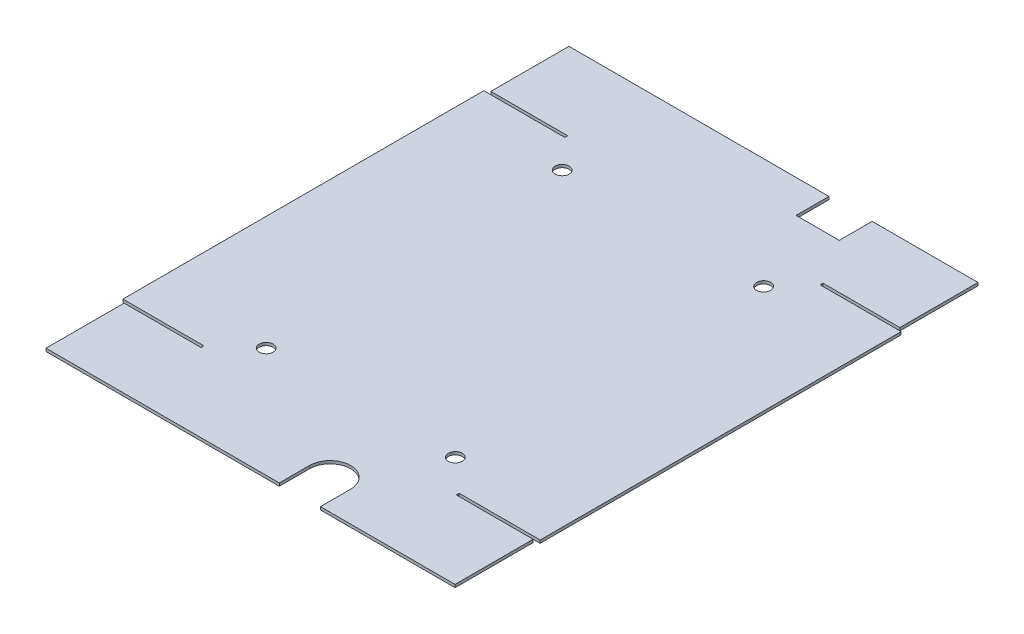
ISO-10303-21;
HEADER;
FILE_DESCRIPTION(('STEP AP214'),'2;1');
FILE_NAME('part.step','',(''),(''),'','','');
FILE_SCHEMA(('AUTOMOTIVE_DESIGN { 1 0 10303 214 1 1 1 1 }'));
ENDSEC;
DATA;
#1=APPLICATION_CONTEXT('core data for automotive mechanical design processes');
#2=APPLICATION_PROTOCOL_DEFINITION('international standard','automotive_design',2000,#1);
#3=PRODUCT_CONTEXT('',#1,'mechanical');
#4=PRODUCT('Part','Part','',(#3));
#5=PRODUCT_RELATED_PRODUCT_CATEGORY('part','',(#4));
#6=PRODUCT_DEFINITION_FORMATION('','',#4);
#7=PRODUCT_DEFINITION_CONTEXT('part definition',#1,'design');
#8=PRODUCT_DEFINITION('design','',#6,#7);
#9=PRODUCT_DEFINITION_SHAPE('','',#8);
#10=(LENGTH_UNIT() NAMED_UNIT(*) SI_UNIT(.MILLI.,.METRE.));
#11=(NAMED_UNIT(*) PLANE_ANGLE_UNIT() SI_UNIT($,.RADIAN.));
#12=(NAMED_UNIT(*) SI_UNIT($,.STERADIAN.) SOLID_ANGLE_UNIT());
#13=UNCERTAINTY_MEASURE_WITH_UNIT(LENGTH_MEASURE(1.E-05),#10,'distance_accuracy_value','');
#14=(GEOMETRIC_REPRESENTATION_CONTEXT(3) GLOBAL_UNCERTAINTY_ASSIGNED_CONTEXT((#13)) GLOBAL_UNIT_ASSIGNED_CONTEXT((#10,
#11,#12)) REPRESENTATION_CONTEXT('',''));
#15=CARTESIAN_POINT('',(0.,0.,0.));
#16=DIRECTION('',(0.,0.,1.));
#17=DIRECTION('',(1.,0.,0.));
#18=AXIS2_PLACEMENT_3D('',#15,#16,#17);
#19=CARTESIAN_POINT('',(0.,-0.7,87.8));
#20=DIRECTION('',(0.,1.,0.));
#21=DIRECTION('',(0.,0.,1.));
#22=AXIS2_PLACEMENT_3D('',#19,#20,#21);
#23=PLANE('',#22);
#24=CARTESIAN_POINT('',(54.05,-0.7,80.7));
#25=DIRECTION('',(0.,1.,0.));
#26=DIRECTION('',(0.,0.,1.));
#27=AXIS2_PLACEMENT_3D('',#24,#25,#26);
#28=CIRCLE('',#27,1.7);
#29=CARTESIAN_POINT('',(54.05,-0.7,82.4));
#30=VERTEX_POINT('',#29);
#31=EDGE_CURVE('E568',#30,#30,#28,.T.);
#32=ORIENTED_EDGE('',*,*,#31,.T.);
#33=EDGE_LOOP('',(#32));
#34=FACE_BOUND('',#33,.T.);
#35=CARTESIAN_POINT('',(8.05,-0.7,80.7));
#36=DIRECTION('',(0.,1.,0.));
#37=DIRECTION('',(0.,0.,1.));
#38=AXIS2_PLACEMENT_3D('',#35,#36,#37);
#39=CIRCLE('',#38,1.7);
#40=CARTESIAN_POINT('',(8.05,-0.7,82.4));
#41=VERTEX_POINT('',#40);
#42=EDGE_CURVE('E577',#41,#41,#39,.T.);
#43=ORIENTED_EDGE('',*,*,#42,.T.);
#44=EDGE_LOOP('',(#43));
#45=FACE_BOUND('',#44,.T.);
#46=CARTESIAN_POINT('',(55.55,-0.7,7.2));
#47=DIRECTION('',(0.,1.,0.));
#48=DIRECTION('',(0.,0.,1.));
#49=AXIS2_PLACEMENT_3D('',#46,#47,#48);
#50=CIRCLE('',#49,1.7);
#51=CARTESIAN_POINT('',(55.55,-0.7,8.9));
#52=VERTEX_POINT('',#51);
#53=EDGE_CURVE('E588',#52,#52,#50,.T.);
#54=ORIENTED_EDGE('',*,*,#53,.T.);
#55=EDGE_LOOP('',(#54));
#56=FACE_BOUND('',#55,.T.);
#57=CARTESIAN_POINT('',(6.55,-0.7,7.2));
#58=DIRECTION('',(0.,1.,0.));
#59=DIRECTION('',(0.,0.,1.));
#60=AXIS2_PLACEMENT_3D('',#57,#58,#59);
#61=CIRCLE('',#60,1.7);
#62=CARTESIAN_POINT('',(6.55,-0.7,8.9));
#63=VERTEX_POINT('',#62);
#64=EDGE_CURVE('E596',#63,#63,#61,.T.);
#65=ORIENTED_EDGE('',*,*,#64,.T.);
#66=EDGE_LOOP('',(#65));
#67=FACE_BOUND('',#66,.T.);
#68=DIRECTION('',(1.,0.,0.));
#69=VECTOR('',#68,1.);
#70=CARTESIAN_POINT('',(-0.78539816339745,-0.7,0.));
#71=LINE('',#70,#69);
#72=CARTESIAN_POINT('',(0.,-0.7,0.));
#73=VERTEX_POINT('',#72);
#74=CARTESIAN_POINT('',(-19.7,-0.699999999999872,0.));
#75=VERTEX_POINT('',#74);
#76=EDGE_CURVE('E733',#73,#75,#71,.F.);
#77=ORIENTED_EDGE('',*,*,#76,.F.);
#78=DIRECTION('',(0.,0.,1.));
#79=VECTOR('',#78,1.);
#80=CARTESIAN_POINT('',(0.,-0.7,-0.785398163397455));
#81=LINE('',#80,#79);
#82=CARTESIAN_POINT('',(0.,-0.699999999999992,-0.700000000000006));
#83=VERTEX_POINT('',#82);
#84=EDGE_CURVE('E561',#83,#73,#81,.T.);
#85=ORIENTED_EDGE('',*,*,#84,.F.);
#86=DIRECTION('',(1.,0.,0.));
#87=VECTOR('',#86,1.);
#88=CARTESIAN_POINT('',(0.299999999999995,-0.699999999999999,-0.700000000000006));
#89=LINE('',#88,#87);
#90=CARTESIAN_POINT('',(-18.7,-0.699999999999867,-0.700000000000006));
#91=VERTEX_POINT('',#90);
#92=EDGE_CURVE('E516',#83,#91,#89,.F.);
#93=ORIENTED_EDGE('',*,*,#92,.T.);
#94=DIRECTION('',(0.,0.,1.));
#95=VECTOR('',#94,1.);
#96=CARTESIAN_POINT('',(-18.7,-0.699999999999879,1.));
#97=LINE('',#96,#95);
#98=CARTESIAN_POINT('',(-18.7,-0.699999999999734,-19.7));
#99=VERTEX_POINT('',#98);
#100=EDGE_CURVE('E513',#91,#99,#97,.F.);
#101=ORIENTED_EDGE('',*,*,#100,.T.);
#102=DIRECTION('',(-1.,0.,0.));
#103=VECTOR('',#102,1.);
#104=CARTESIAN_POINT('',(0.299999999999994,-0.699999999999867,-19.7));
#105=LINE('',#104,#103);
#106=CARTESIAN_POINT('',(44.5506007,-0.699999999999859,-19.7));
#107=VERTEX_POINT('',#106);
#108=EDGE_CURVE('E510',#99,#107,#105,.F.);
#109=ORIENTED_EDGE('',*,*,#108,.T.);
#110=DIRECTION('',(0.,0.,1.));
#111=VECTOR('',#110,1.);
#112=CARTESIAN_POINT('',(44.5506007,-0.699999999999915,-11.7));
#113=LINE('',#112,#111);
#114=CARTESIAN_POINT('',(44.5506007,-0.699999999999915,-11.7));
#115=VERTEX_POINT('',#114);
#116=EDGE_CURVE('E460',#107,#115,#113,.T.);
#117=ORIENTED_EDGE('',*,*,#116,.T.);
#118=DIRECTION('',(1.,0.,0.));
#119=VECTOR('',#118,1.);
#120=CARTESIAN_POINT('',(55.0506007,-0.699999999999915,-11.7));
#121=LINE('',#120,#119);
#122=CARTESIAN_POINT('',(55.0506007,-0.699999999999915,-11.7));
#123=VERTEX_POINT('',#122);
#124=EDGE_CURVE('E789',#115,#123,#121,.T.);
#125=ORIENTED_EDGE('',*,*,#124,.T.);
#126=DIRECTION('',(0.,0.,-1.));
#127=VECTOR('',#126,1.);
#128=CARTESIAN_POINT('',(55.0506007,-0.699999999999859,-19.7));
#129=LINE('',#128,#127);
#130=CARTESIAN_POINT('',(55.0506007,-0.699999999999859,-19.7));
#131=VERTEX_POINT('',#130);
#132=EDGE_CURVE('E788',#123,#131,#129,.T.);
#133=ORIENTED_EDGE('',*,*,#132,.T.);
#134=DIRECTION('',(-1.,0.,0.));
#135=VECTOR('',#134,1.);
#136=CARTESIAN_POINT('',(61.7999999999998,-0.699999999999869,-19.7));
#137=LINE('',#136,#135);
#138=CARTESIAN_POINT('',(80.8,-0.69999999999973,-19.7));
#139=VERTEX_POINT('',#138);
#140=EDGE_CURVE('E541',#131,#139,#137,.F.);
#141=ORIENTED_EDGE('',*,*,#140,.T.);
#142=DIRECTION('',(0.,0.,-1.));
#143=VECTOR('',#142,1.);
#144=CARTESIAN_POINT('',(80.8,-0.699999999999872,1.));
#145=LINE('',#144,#143);
#146=CARTESIAN_POINT('',(80.8,-0.699999999999866,-0.700000000000006));
#147=VERTEX_POINT('',#146);
#148=EDGE_CURVE('E539',#139,#147,#145,.F.);
#149=ORIENTED_EDGE('',*,*,#148,.T.);
#150=DIRECTION('',(1.,0.,0.));
#151=VECTOR('',#150,1.);
#152=CARTESIAN_POINT('',(61.7999999999998,-0.700000000000005,-0.700000000000006));
#153=LINE('',#152,#151);
#154=CARTESIAN_POINT('',(62.1,-0.699999999999992,-0.700000000000006));
#155=VERTEX_POINT('',#154);
#156=EDGE_CURVE('E537',#147,#155,#153,.F.);
#157=ORIENTED_EDGE('',*,*,#156,.T.);
#158=DIRECTION('',(0.,0.,1.));
#159=VECTOR('',#158,1.);
#160=CARTESIAN_POINT('',(62.1,-0.7,-0.785398163397455));
#161=LINE('',#160,#159);
#162=CARTESIAN_POINT('',(62.1,-0.700000000000003,0.));
#163=VERTEX_POINT('',#162);
#164=EDGE_CURVE('E454',#163,#155,#161,.F.);
#165=ORIENTED_EDGE('',*,*,#164,.F.);
#166=DIRECTION('',(1.,0.,0.));
#167=VECTOR('',#166,1.);
#168=CARTESIAN_POINT('',(62.8853981633975,-0.7,0.));
#169=LINE('',#168,#167);
#170=CARTESIAN_POINT('',(81.8,-0.699999999999867,0.));
#171=VERTEX_POINT('',#170);
#172=EDGE_CURVE('E231',#171,#163,#169,.F.);
#173=ORIENTED_EDGE('',*,*,#172,.F.);
#174=DIRECTION('',(0.,0.,-1.));
#175=VECTOR('',#174,1.);
#176=CARTESIAN_POINT('',(81.8,-0.699999999999867,0.));
#177=LINE('',#176,#175);
#178=CARTESIAN_POINT('',(81.8,-0.699999999999867,87.8));
#179=VERTEX_POINT('',#178);
#180=EDGE_CURVE('E418',#171,#179,#177,.F.);
#181=ORIENTED_EDGE('',*,*,#180,.T.);
#182=DIRECTION('',(1.,0.,0.));
#183=VECTOR('',#182,1.);
#184=CARTESIAN_POINT('',(62.8853981633975,-0.7,87.8));
#185=LINE('',#184,#183);
#186=CARTESIAN_POINT('',(62.1,-0.7,87.8));
#187=VERTEX_POINT('',#186);
#188=EDGE_CURVE('E419',#187,#179,#185,.T.);
#189=ORIENTED_EDGE('',*,*,#188,.F.);
#190=DIRECTION('',(0.,0.,1.));
#191=VECTOR('',#190,1.);
#192=CARTESIAN_POINT('',(62.1,-0.7,88.5853981633975));
#193=LINE('',#192,#191);
#194=CARTESIAN_POINT('',(62.1,-0.700000000000006,88.5));
#195=VERTEX_POINT('',#194);
#196=EDGE_CURVE('E448',#195,#187,#193,.F.);
#197=ORIENTED_EDGE('',*,*,#196,.F.);
#198=DIRECTION('',(-1.,0.,0.));
#199=VECTOR('',#198,1.);
#200=CARTESIAN_POINT('',(149.6,-0.699999999999396,88.5));
#201=LINE('',#200,#199);
#202=CARTESIAN_POINT('',(80.8,-0.699999999999867,88.5));
#203=VERTEX_POINT('',#202);
#204=EDGE_CURVE('E692',#195,#203,#201,.F.);
#205=ORIENTED_EDGE('',*,*,#204,.T.);
#206=DIRECTION('',(0.,0.,-1.));
#207=VECTOR('',#206,1.);
#208=CARTESIAN_POINT('',(80.8,-0.699999999999867,86.7999999999997));
#209=LINE('',#208,#207);
#210=CARTESIAN_POINT('',(80.8,-0.699999999999729,107.5));
#211=VERTEX_POINT('',#210);
#212=EDGE_CURVE('E685',#203,#211,#209,.F.);
#213=ORIENTED_EDGE('',*,*,#212,.T.);
#214=DIRECTION('',(1.,0.,0.));
#215=VECTOR('',#214,1.);
#216=CARTESIAN_POINT('',(149.6,-0.699999999999257,107.5));
#217=LINE('',#216,#215);
#218=CARTESIAN_POINT('',(48.05,-0.699999999999923,107.5));
#219=VERTEX_POINT('',#218);
#220=EDGE_CURVE('E683',#211,#219,#217,.F.);
#221=ORIENTED_EDGE('',*,*,#220,.T.);
#222=DIRECTION('',(0.,0.,-1.));
#223=VECTOR('',#222,1.);
#224=CARTESIAN_POINT('',(48.05,-0.699999999999923,107.5));
#225=LINE('',#224,#223);
#226=CARTESIAN_POINT('',(48.05,-0.699999999999951,100.15));
#227=VERTEX_POINT('',#226);
#228=EDGE_CURVE('E663',#219,#227,#225,.T.);
#229=ORIENTED_EDGE('',*,*,#228,.T.);
#230=CARTESIAN_POINT('',(43.05,-0.699999999999951,100.15));
#231=DIRECTION('',(0.,1.,0.));
#232=DIRECTION('',(1.,0.,0.));
#233=AXIS2_PLACEMENT_3D('',#230,#231,#232);
#234=CIRCLE('',#233,5.);
#235=CARTESIAN_POINT('',(38.05,-0.699999999999951,100.15));
#236=VERTEX_POINT('',#235);
#237=EDGE_CURVE('E660',#227,#236,#234,.T.);
#238=ORIENTED_EDGE('',*,*,#237,.T.);
#239=DIRECTION('',(0.,0.,1.));
#240=VECTOR('',#239,1.);
#241=CARTESIAN_POINT('',(38.05,-0.699999999999951,100.15));
#242=LINE('',#241,#240);
#243=CARTESIAN_POINT('',(38.05,-0.699999999999923,107.5));
#244=VERTEX_POINT('',#243);
#245=EDGE_CURVE('E656',#236,#244,#242,.T.);
#246=ORIENTED_EDGE('',*,*,#245,.T.);
#247=DIRECTION('',(1.,0.,0.));
#248=VECTOR('',#247,1.);
#249=CARTESIAN_POINT('',(-87.5,-0.699999999999257,107.5));
#250=LINE('',#249,#248);
#251=CARTESIAN_POINT('',(-18.7,-0.699999999999742,107.5));
#252=VERTEX_POINT('',#251);
#253=EDGE_CURVE('E1328',#244,#252,#250,.F.);
#254=ORIENTED_EDGE('',*,*,#253,.T.);
#255=DIRECTION('',(0.,0.,1.));
#256=VECTOR('',#255,1.);
#257=CARTESIAN_POINT('',(-18.7,-0.699999999999881,86.7999999999997));
#258=LINE('',#257,#256);
#259=CARTESIAN_POINT('',(-18.7,-0.699999999999867,88.5));
#260=VERTEX_POINT('',#259);
#261=EDGE_CURVE('E1331',#252,#260,#258,.F.);
#262=ORIENTED_EDGE('',*,*,#261,.T.);
#263=DIRECTION('',(-1.,0.,0.));
#264=VECTOR('',#263,1.);
#265=CARTESIAN_POINT('',(-87.5,-0.699999999999396,88.5000000000001));
#266=LINE('',#265,#264);
#267=CARTESIAN_POINT('',(0.,-0.699999999999978,88.5));
#268=VERTEX_POINT('',#267);
#269=EDGE_CURVE('E1333',#260,#268,#266,.F.);
#270=ORIENTED_EDGE('',*,*,#269,.T.);
#271=DIRECTION('',(0.,0.,1.));
#272=VECTOR('',#271,1.);
#273=CARTESIAN_POINT('',(0.,-0.7,88.5853981633975));
#274=LINE('',#273,#272);
#275=CARTESIAN_POINT('',(0.,-0.7,87.8));
#276=VERTEX_POINT('',#275);
#277=EDGE_CURVE('E239',#276,#268,#274,.T.);
#278=ORIENTED_EDGE('',*,*,#277,.F.);
#279=DIRECTION('',(1.,0.,0.));
#280=VECTOR('',#279,1.);
#281=CARTESIAN_POINT('',(-0.78539816339745,-0.7,87.8));
#282=LINE('',#281,#280);
#283=CARTESIAN_POINT('',(-19.7,-0.699999999999872,87.8));
#284=VERTEX_POINT('',#283);
#285=EDGE_CURVE('E727',#284,#276,#282,.T.);
#286=ORIENTED_EDGE('',*,*,#285,.F.);
#287=DIRECTION('',(0.,0.,1.));
#288=VECTOR('',#287,1.);
#289=CARTESIAN_POINT('',(-19.7,-0.699999999999872,0.));
#290=LINE('',#289,#288);
#291=EDGE_CURVE('E744',#284,#75,#290,.F.);
#292=ORIENTED_EDGE('',*,*,#291,.T.);
#293=EDGE_LOOP('',(#77,#85,#93,#101,#109,#117,#125,#133,#141,#149,#157,#165,#173,#181,#189,#197,
#205,#213,#221,#229,#238,#246,#254,#262,#270,#278,#286,#292));
#294=FACE_BOUND('',#293,.T.);
#295=ADVANCED_FACE('F216',(#34,#45,#56,#67,#294),#23,.F.);
#296=CARTESIAN_POINT('',(0.,0.,87.8));
#297=DIRECTION('',(0.,1.,0.));
#298=DIRECTION('',(0.,0.,1.));
#299=AXIS2_PLACEMENT_3D('',#296,#297,#298);
#300=PLANE('',#299);
#301=CARTESIAN_POINT('',(54.05,0.,80.7));
#302=DIRECTION('',(0.,1.,0.));
#303=DIRECTION('',(0.,0.,1.));
#304=AXIS2_PLACEMENT_3D('',#301,#302,#303);
#305=CIRCLE('',#304,1.7);
#306=CARTESIAN_POINT('',(54.05,0.,82.4));
#307=VERTEX_POINT('',#306);
#308=EDGE_CURVE('E572',#307,#307,#305,.T.);
#309=ORIENTED_EDGE('',*,*,#308,.F.);
#310=EDGE_LOOP('',(#309));
#311=FACE_BOUND('',#310,.T.);
#312=CARTESIAN_POINT('',(8.05,0.,80.7));
#313=DIRECTION('',(0.,1.,0.));
#314=DIRECTION('',(0.,0.,1.));
#315=AXIS2_PLACEMENT_3D('',#312,#313,#314);
#316=CIRCLE('',#315,1.7);
#317=CARTESIAN_POINT('',(8.05,0.,82.4));
#318=VERTEX_POINT('',#317);
#319=EDGE_CURVE('E571',#318,#318,#316,.T.);
#320=ORIENTED_EDGE('',*,*,#319,.F.);
#321=EDGE_LOOP('',(#320));
#322=FACE_BOUND('',#321,.T.);
#323=CARTESIAN_POINT('',(55.55,0.,7.2));
#324=DIRECTION('',(0.,1.,0.));
#325=DIRECTION('',(0.,0.,1.));
#326=AXIS2_PLACEMENT_3D('',#323,#324,#325);
#327=CIRCLE('',#326,1.7);
#328=CARTESIAN_POINT('',(55.55,0.,8.9));
#329=VERTEX_POINT('',#328);
#330=EDGE_CURVE('E591',#329,#329,#327,.T.);
#331=ORIENTED_EDGE('',*,*,#330,.F.);
#332=EDGE_LOOP('',(#331));
#333=FACE_BOUND('',#332,.T.);
#334=CARTESIAN_POINT('',(6.55,0.,7.2));
#335=DIRECTION('',(0.,1.,0.));
#336=DIRECTION('',(0.,0.,1.));
#337=AXIS2_PLACEMENT_3D('',#334,#335,#336);
#338=CIRCLE('',#337,1.7);
#339=CARTESIAN_POINT('',(6.55,0.,8.9));
#340=VERTEX_POINT('',#339);
#341=EDGE_CURVE('E590',#340,#340,#338,.T.);
#342=ORIENTED_EDGE('',*,*,#341,.F.);
#343=EDGE_LOOP('',(#342));
#344=FACE_BOUND('',#343,.T.);
#345=DIRECTION('',(-1.,0.,0.));
#346=VECTOR('',#345,1.);
#347=CARTESIAN_POINT('',(62.1,0.,0.));
#348=LINE('',#347,#346);
#349=CARTESIAN_POINT('',(81.8,1.38777878078145E-13,0.));
#350=VERTEX_POINT('',#349);
#351=CARTESIAN_POINT('',(62.1,0.,0.));
#352=VERTEX_POINT('',#351);
#353=EDGE_CURVE('E399',#350,#352,#348,.T.);
#354=ORIENTED_EDGE('',*,*,#353,.T.);
#355=DIRECTION('',(0.,0.,-1.));
#356=VECTOR('',#355,1.);
#357=CARTESIAN_POINT('',(62.1,0.,-0.699999999999992));
#358=LINE('',#357,#356);
#359=CARTESIAN_POINT('',(62.1,0.,-0.700000000000006));
#360=VERTEX_POINT('',#359);
#361=EDGE_CURVE('E563',#352,#360,#358,.T.);
#362=ORIENTED_EDGE('',*,*,#361,.T.);
#363=DIRECTION('',(-1.,0.,0.));
#364=VECTOR('',#363,1.);
#365=CARTESIAN_POINT('',(60.8,0.,-0.700000000000006));
#366=LINE('',#365,#364);
#367=CARTESIAN_POINT('',(80.8,1.40295761119624E-13,-0.699999999999992));
#368=VERTEX_POINT('',#367);
#369=EDGE_CURVE('E492',#368,#360,#366,.T.);
#370=ORIENTED_EDGE('',*,*,#369,.F.);
#371=DIRECTION('',(0.,0.,1.));
#372=VECTOR('',#371,1.);
#373=CARTESIAN_POINT('',(80.8,1.40295761119624E-13,-0.699999999999992));
#374=LINE('',#373,#372);
#375=CARTESIAN_POINT('',(80.8,2.76037873114809E-13,-19.7));
#376=VERTEX_POINT('',#375);
#377=EDGE_CURVE('E503',#376,#368,#374,.T.);
#378=ORIENTED_EDGE('',*,*,#377,.F.);
#379=DIRECTION('',(1.,0.,0.));
#380=VECTOR('',#379,1.);
#381=CARTESIAN_POINT('',(80.8,2.76037873114809E-13,-19.7));
#382=LINE('',#381,#380);
#383=CARTESIAN_POINT('',(55.0506007,1.40946282423116E-13,-19.7));
#384=VERTEX_POINT('',#383);
#385=EDGE_CURVE('E558',#384,#376,#382,.T.);
#386=ORIENTED_EDGE('',*,*,#385,.F.);
#387=DIRECTION('',(0.,0.,-1.));
#388=VECTOR('',#387,1.);
#389=CARTESIAN_POINT('',(55.0506007,1.40946282423116E-13,-19.7));
#390=LINE('',#389,#388);
#391=CARTESIAN_POINT('',(55.0506007,0.,-11.7));
#392=VERTEX_POINT('',#391);
#393=EDGE_CURVE('E455',#392,#384,#390,.T.);
#394=ORIENTED_EDGE('',*,*,#393,.F.);
#395=DIRECTION('',(1.,0.,0.));
#396=VECTOR('',#395,1.);
#397=CARTESIAN_POINT('',(55.0506007,0.,-11.7));
#398=LINE('',#397,#396);
#399=CARTESIAN_POINT('',(44.5506007,0.,-11.7));
#400=VERTEX_POINT('',#399);
#401=EDGE_CURVE('E471',#400,#392,#398,.T.);
#402=ORIENTED_EDGE('',*,*,#401,.F.);
#403=DIRECTION('',(0.,0.,1.));
#404=VECTOR('',#403,1.);
#405=CARTESIAN_POINT('',(44.5506007,0.,-11.7));
#406=LINE('',#405,#404);
#407=CARTESIAN_POINT('',(44.5506007,1.40946282423116E-13,-19.7));
#408=VERTEX_POINT('',#407);
#409=EDGE_CURVE('E481',#408,#400,#406,.T.);
#410=ORIENTED_EDGE('',*,*,#409,.F.);
#411=DIRECTION('',(1.,0.,0.));
#412=VECTOR('',#411,1.);
#413=CARTESIAN_POINT('',(1.29999999999999,1.2641797331181E-13,-19.7));
#414=LINE('',#413,#412);
#415=CARTESIAN_POINT('',(-18.7,2.66063213127943E-13,-19.7));
#416=VERTEX_POINT('',#415);
#417=EDGE_CURVE('E525',#416,#408,#414,.T.);
#418=ORIENTED_EDGE('',*,*,#417,.F.);
#419=DIRECTION('',(0.,0.,-1.));
#420=VECTOR('',#419,1.);
#421=CARTESIAN_POINT('',(-18.7,2.66063213127943E-13,-19.7));
#422=LINE('',#421,#420);
#423=CARTESIAN_POINT('',(-18.7,1.33356867215717E-13,-0.700000000000006));
#424=VERTEX_POINT('',#423);
#425=EDGE_CURVE('E520',#424,#416,#422,.T.);
#426=ORIENTED_EDGE('',*,*,#425,.F.);
#427=DIRECTION('',(-1.,0.,0.));
#428=VECTOR('',#427,1.);
#429=CARTESIAN_POINT('',(-18.7,1.33356867215717E-13,-0.700000000000006));
#430=LINE('',#429,#428);
#431=CARTESIAN_POINT('',(0.,0.,-0.699999999999992));
#432=VERTEX_POINT('',#431);
#433=EDGE_CURVE('E533',#432,#424,#430,.T.);
#434=ORIENTED_EDGE('',*,*,#433,.F.);
#435=DIRECTION('',(0.,0.,1.));
#436=VECTOR('',#435,1.);
#437=CARTESIAN_POINT('',(0.,0.,0.));
#438=LINE('',#437,#436);
#439=CARTESIAN_POINT('',(0.,0.,0.));
#440=VERTEX_POINT('',#439);
#441=EDGE_CURVE('E565',#432,#440,#438,.T.);
#442=ORIENTED_EDGE('',*,*,#441,.T.);
#443=DIRECTION('',(-1.,0.,0.));
#444=VECTOR('',#443,1.);
#445=CARTESIAN_POINT('',(-0.699999999999997,0.,0.));
#446=LINE('',#445,#444);
#447=CARTESIAN_POINT('',(-19.7,1.2793585635329E-13,0.));
#448=VERTEX_POINT('',#447);
#449=EDGE_CURVE('E721',#440,#448,#446,.T.);
#450=ORIENTED_EDGE('',*,*,#449,.T.);
#451=DIRECTION('',(0.,0.,-1.));
#452=VECTOR('',#451,1.);
#453=CARTESIAN_POINT('',(-19.7,1.2793585635329E-13,0.));
#454=LINE('',#453,#452);
#455=CARTESIAN_POINT('',(-19.7,1.2793585635329E-13,87.8));
#456=VERTEX_POINT('',#455);
#457=EDGE_CURVE('E409',#456,#448,#454,.T.);
#458=ORIENTED_EDGE('',*,*,#457,.F.);
#459=DIRECTION('',(1.,0.,0.));
#460=VECTOR('',#459,1.);
#461=CARTESIAN_POINT('',(0.,0.,87.8));
#462=LINE('',#461,#460);
#463=CARTESIAN_POINT('',(0.,0.,87.8));
#464=VERTEX_POINT('',#463);
#465=EDGE_CURVE('E715',#456,#464,#462,.T.);
#466=ORIENTED_EDGE('',*,*,#465,.T.);
#467=DIRECTION('',(0.,0.,1.));
#468=VECTOR('',#467,1.);
#469=CARTESIAN_POINT('',(0.,0.,88.5));
#470=LINE('',#469,#468);
#471=CARTESIAN_POINT('',(0.,0.,88.5));
#472=VERTEX_POINT('',#471);
#473=EDGE_CURVE('E444',#464,#472,#470,.T.);
#474=ORIENTED_EDGE('',*,*,#473,.T.);
#475=DIRECTION('',(1.,0.,0.));
#476=VECTOR('',#475,1.);
#477=CARTESIAN_POINT('',(1.29999999999998,0.,88.5));
#478=LINE('',#477,#476);
#479=CARTESIAN_POINT('',(-18.7,1.2490009027033E-13,88.5));
#480=VERTEX_POINT('',#479);
#481=EDGE_CURVE('E639',#480,#472,#478,.T.);
#482=ORIENTED_EDGE('',*,*,#481,.F.);
#483=DIRECTION('',(0.,0.,-1.));
#484=VECTOR('',#483,1.);
#485=CARTESIAN_POINT('',(-18.7,1.2490009027033E-13,88.5));
#486=LINE('',#485,#484);
#487=CARTESIAN_POINT('',(-18.7,2.63677968348475E-13,107.5));
#488=VERTEX_POINT('',#487);
#489=EDGE_CURVE('E686',#488,#480,#486,.T.);
#490=ORIENTED_EDGE('',*,*,#489,.F.);
#491=DIRECTION('',(-1.,0.,0.));
#492=VECTOR('',#491,1.);
#493=CARTESIAN_POINT('',(-18.7,2.63677968348475E-13,107.5));
#494=LINE('',#493,#492);
#495=CARTESIAN_POINT('',(38.05,1.52655665885959E-13,107.5));
#496=VERTEX_POINT('',#495);
#497=EDGE_CURVE('E710',#496,#488,#494,.T.);
#498=ORIENTED_EDGE('',*,*,#497,.F.);
#499=DIRECTION('',(0.,0.,1.));
#500=VECTOR('',#499,1.);
#501=CARTESIAN_POINT('',(38.05,0.,100.15));
#502=LINE('',#501,#500);
#503=CARTESIAN_POINT('',(38.05,0.,100.15));
#504=VERTEX_POINT('',#503);
#505=EDGE_CURVE('E634',#504,#496,#502,.T.);
#506=ORIENTED_EDGE('',*,*,#505,.F.);
#507=CARTESIAN_POINT('',(43.05,0.,100.15));
#508=DIRECTION('',(0.,1.,0.));
#509=DIRECTION('',(1.,0.,0.));
#510=AXIS2_PLACEMENT_3D('',#507,#508,#509);
#511=CIRCLE('',#510,5.);
#512=CARTESIAN_POINT('',(48.05,0.,100.15));
#513=VERTEX_POINT('',#512);
#514=EDGE_CURVE('E650',#513,#504,#511,.T.);
#515=ORIENTED_EDGE('',*,*,#514,.F.);
#516=DIRECTION('',(0.,0.,-1.));
#517=VECTOR('',#516,1.);
#518=CARTESIAN_POINT('',(48.05,0.,107.5));
#519=LINE('',#518,#517);
#520=CARTESIAN_POINT('',(48.05,0.,107.5));
#521=VERTEX_POINT('',#520);
#522=EDGE_CURVE('E620',#521,#513,#519,.T.);
#523=ORIENTED_EDGE('',*,*,#522,.F.);
#524=DIRECTION('',(-1.,0.,0.));
#525=VECTOR('',#524,1.);
#526=CARTESIAN_POINT('',(60.8,1.38777878078145E-13,107.5));
#527=LINE('',#526,#525);
#528=CARTESIAN_POINT('',(80.8,2.77555756156289E-13,107.5));
#529=VERTEX_POINT('',#528);
#530=EDGE_CURVE('E676',#529,#521,#527,.T.);
#531=ORIENTED_EDGE('',*,*,#530,.F.);
#532=DIRECTION('',(0.,0.,1.));
#533=VECTOR('',#532,1.);
#534=CARTESIAN_POINT('',(80.8,2.77555756156289E-13,107.5));
#535=LINE('',#534,#533);
#536=CARTESIAN_POINT('',(80.8,1.38777878078145E-13,88.5));
#537=VERTEX_POINT('',#536);
#538=EDGE_CURVE('E700',#537,#529,#535,.T.);
#539=ORIENTED_EDGE('',*,*,#538,.F.);
#540=DIRECTION('',(1.,0.,0.));
#541=VECTOR('',#540,1.);
#542=CARTESIAN_POINT('',(80.8,1.38777878078145E-13,88.5));
#543=LINE('',#542,#541);
#544=CARTESIAN_POINT('',(62.1,0.,88.5));
#545=VERTEX_POINT('',#544);
#546=EDGE_CURVE('E1336',#545,#537,#543,.T.);
#547=ORIENTED_EDGE('',*,*,#546,.F.);
#548=DIRECTION('',(0.,0.,-1.));
#549=VECTOR('',#548,1.);
#550=CARTESIAN_POINT('',(62.1,0.,87.8));
#551=LINE('',#550,#549);
#552=CARTESIAN_POINT('',(62.1,0.,87.8));
#553=VERTEX_POINT('',#552);
#554=EDGE_CURVE('E438',#545,#553,#551,.T.);
#555=ORIENTED_EDGE('',*,*,#554,.T.);
#556=DIRECTION('',(1.,0.,0.));
#557=VECTOR('',#556,1.);
#558=CARTESIAN_POINT('',(62.8,0.,87.8));
#559=LINE('',#558,#557);
#560=CARTESIAN_POINT('',(81.8,1.38777878078145E-13,87.8));
#561=VERTEX_POINT('',#560);
#562=EDGE_CURVE('E410',#553,#561,#559,.T.);
#563=ORIENTED_EDGE('',*,*,#562,.T.);
#564=DIRECTION('',(0.,0.,1.));
#565=VECTOR('',#564,1.);
#566=CARTESIAN_POINT('',(81.8,1.38777878078145E-13,87.8));
#567=LINE('',#566,#565);
#568=EDGE_CURVE('E416',#350,#561,#567,.T.);
#569=ORIENTED_EDGE('',*,*,#568,.F.);
#570=EDGE_LOOP('',(#354,#362,#370,#378,#386,#394,#402,#410,#418,#426,#434,#442,#450,#458,#466,
#474,#482,#490,#498,#506,#515,#523,#531,#539,#547,#555,#563,#569));
#571=FACE_BOUND('',#570,.T.);
#572=ADVANCED_FACE('F218',(#311,#322,#333,#344,#571),#300,.T.);
#573=CARTESIAN_POINT('',(6.55,-0.7,7.2));
#574=DIRECTION('',(0.,1.,0.));
#575=DIRECTION('',(0.,0.,1.));
#576=AXIS2_PLACEMENT_3D('',#573,#574,#575);
#577=CYLINDRICAL_SURFACE('',#576,1.7);
#578=ORIENTED_EDGE('',*,*,#64,.F.);
#579=EDGE_LOOP('',(#578));
#580=FACE_BOUND('',#579,.T.);
#581=ORIENTED_EDGE('',*,*,#341,.T.);
#582=EDGE_LOOP('',(#581));
#583=FACE_BOUND('',#582,.T.);
#584=ADVANCED_FACE('F820',(#580,#583),#577,.F.);
#585=CARTESIAN_POINT('',(55.55,-0.7,7.2));
#586=DIRECTION('',(0.,1.,0.));
#587=DIRECTION('',(0.,0.,1.));
#588=AXIS2_PLACEMENT_3D('',#585,#586,#587);
#589=CYLINDRICAL_SURFACE('',#588,1.7);
#590=ORIENTED_EDGE('',*,*,#53,.F.);
#591=EDGE_LOOP('',(#590));
#592=FACE_BOUND('',#591,.T.);
#593=ORIENTED_EDGE('',*,*,#330,.T.);
#594=EDGE_LOOP('',(#593));
#595=FACE_BOUND('',#594,.T.);
#596=ADVANCED_FACE('F826',(#592,#595),#589,.F.);
#597=CARTESIAN_POINT('',(8.05,-0.7,80.7));
#598=DIRECTION('',(0.,1.,0.));
#599=DIRECTION('',(0.,0.,1.));
#600=AXIS2_PLACEMENT_3D('',#597,#598,#599);
#601=CYLINDRICAL_SURFACE('',#600,1.7);
#602=ORIENTED_EDGE('',*,*,#42,.F.);
#603=EDGE_LOOP('',(#602));
#604=FACE_BOUND('',#603,.T.);
#605=ORIENTED_EDGE('',*,*,#319,.T.);
#606=EDGE_LOOP('',(#605));
#607=FACE_BOUND('',#606,.T.);
#608=ADVANCED_FACE('F830',(#604,#607),#601,.F.);
#609=CARTESIAN_POINT('',(54.05,-0.7,80.7));
#610=DIRECTION('',(0.,1.,0.));
#611=DIRECTION('',(0.,0.,1.));
#612=AXIS2_PLACEMENT_3D('',#609,#610,#611);
#613=CYLINDRICAL_SURFACE('',#612,1.7);
#614=ORIENTED_EDGE('',*,*,#31,.F.);
#615=EDGE_LOOP('',(#614));
#616=FACE_BOUND('',#615,.T.);
#617=ORIENTED_EDGE('',*,*,#308,.T.);
#618=EDGE_LOOP('',(#617));
#619=FACE_BOUND('',#618,.T.);
#620=ADVANCED_FACE('F834',(#616,#619),#613,.F.);
#621=CARTESIAN_POINT('',(62.1,0.,-0.699999999999992));
#622=DIRECTION('',(1.,0.,0.));
#623=DIRECTION('',(0.,0.,-1.));
#624=AXIS2_PLACEMENT_3D('',#621,#622,#623);
#625=PLANE('',#624);
#626=DIRECTION('',(0.,-1.,0.));
#627=VECTOR('',#626,1.);
#628=CARTESIAN_POINT('',(62.1,0.,0.));
#629=LINE('',#628,#627);
#630=EDGE_CURVE('E14',#352,#163,#629,.T.);
#631=ORIENTED_EDGE('',*,*,#630,.T.);
#632=ORIENTED_EDGE('',*,*,#164,.T.);
#633=DIRECTION('',(0.,1.,0.));
#634=VECTOR('',#633,1.);
#635=CARTESIAN_POINT('',(62.1,-0.699999999999992,-0.700000000000006));
#636=LINE('',#635,#634);
#637=EDGE_CURVE('E443',#155,#360,#636,.T.);
#638=ORIENTED_EDGE('',*,*,#637,.T.);
#639=ORIENTED_EDGE('',*,*,#361,.F.);
#640=EDGE_LOOP('',(#631,#632,#638,#639));
#641=FACE_BOUND('',#640,.T.);
#642=ADVANCED_FACE('F560',(#641),#625,.T.);
#643=CARTESIAN_POINT('',(0.,0.,0.));
#644=DIRECTION('',(-1.,0.,0.));
#645=DIRECTION('',(0.,0.,1.));
#646=AXIS2_PLACEMENT_3D('',#643,#644,#645);
#647=PLANE('',#646);
#648=ORIENTED_EDGE('',*,*,#84,.T.);
#649=DIRECTION('',(0.,1.,0.));
#650=VECTOR('',#649,1.);
#651=CARTESIAN_POINT('',(0.,-0.7,0.));
#652=LINE('',#651,#650);
#653=EDGE_CURVE('E599',#73,#440,#652,.T.);
#654=ORIENTED_EDGE('',*,*,#653,.T.);
#655=ORIENTED_EDGE('',*,*,#441,.F.);
#656=DIRECTION('',(0.,1.,0.));
#657=VECTOR('',#656,1.);
#658=CARTESIAN_POINT('',(0.,0.,-0.699999999999992));
#659=LINE('',#658,#657);
#660=EDGE_CURVE('E486',#83,#432,#659,.T.);
#661=ORIENTED_EDGE('',*,*,#660,.F.);
#662=EDGE_LOOP('',(#648,#654,#655,#661));
#663=FACE_BOUND('',#662,.T.);
#664=ADVANCED_FACE('F768',(#663),#647,.T.);
#665=CARTESIAN_POINT('',(80.8,2.76037873114809E-13,-19.7));
#666=DIRECTION('',(0.,0.,-1.));
#667=DIRECTION('',(-1.,0.,0.));
#668=AXIS2_PLACEMENT_3D('',#665,#666,#667);
#669=PLANE('',#668);
#670=ORIENTED_EDGE('',*,*,#140,.F.);
#671=DIRECTION('',(0.,1.,0.));
#672=VECTOR('',#671,1.);
#673=CARTESIAN_POINT('',(55.0506007,-0.699999999999859,-19.7));
#674=LINE('',#673,#672);
#675=EDGE_CURVE('E489',#131,#384,#674,.T.);
#676=ORIENTED_EDGE('',*,*,#675,.T.);
#677=ORIENTED_EDGE('',*,*,#385,.T.);
#678=DIRECTION('',(0.,-1.,0.));
#679=VECTOR('',#678,1.);
#680=CARTESIAN_POINT('',(80.8,2.76037873114809E-13,-19.7));
#681=LINE('',#680,#679);
#682=EDGE_CURVE('E800',#376,#139,#681,.T.);
#683=ORIENTED_EDGE('',*,*,#682,.T.);
#684=EDGE_LOOP('',(#670,#676,#677,#683));
#685=FACE_BOUND('',#684,.T.);
#686=ADVANCED_FACE('F799',(#685),#669,.T.);
#687=CARTESIAN_POINT('',(1.29999999999999,1.2641797331181E-13,-19.7));
#688=DIRECTION('',(0.,0.,-1.));
#689=DIRECTION('',(1.,0.,0.));
#690=AXIS2_PLACEMENT_3D('',#687,#688,#689);
#691=PLANE('',#690);
#692=ORIENTED_EDGE('',*,*,#417,.T.);
#693=DIRECTION('',(0.,1.,0.));
#694=VECTOR('',#693,1.);
#695=CARTESIAN_POINT('',(44.5506007,-0.699999999999859,-19.7));
#696=LINE('',#695,#694);
#697=EDGE_CURVE('E478',#107,#408,#696,.T.);
#698=ORIENTED_EDGE('',*,*,#697,.F.);
#699=ORIENTED_EDGE('',*,*,#108,.F.);
#700=DIRECTION('',(0.,-1.,0.));
#701=VECTOR('',#700,1.);
#702=CARTESIAN_POINT('',(-18.7,2.65629532258949E-13,-19.7));
#703=LINE('',#702,#701);
#704=EDGE_CURVE('E518',#416,#99,#703,.T.);
#705=ORIENTED_EDGE('',*,*,#704,.F.);
#706=EDGE_LOOP('',(#692,#698,#699,#705));
#707=FACE_BOUND('',#706,.T.);
#708=ADVANCED_FACE('F779',(#707),#691,.T.);
#709=CARTESIAN_POINT('',(-18.7,2.65629532258949E-13,-19.7));
#710=DIRECTION('',(-1.,0.,0.));
#711=DIRECTION('',(0.,-1.,0.));
#712=AXIS2_PLACEMENT_3D('',#709,#710,#711);
#713=PLANE('',#712);
#714=ORIENTED_EDGE('',*,*,#100,.F.);
#715=DIRECTION('',(0.,-1.,0.));
#716=VECTOR('',#715,1.);
#717=CARTESIAN_POINT('',(-18.7,1.33356867215717E-13,-0.700000000000006));
#718=LINE('',#717,#716);
#719=EDGE_CURVE('E496',#424,#91,#718,.T.);
#720=ORIENTED_EDGE('',*,*,#719,.F.);
#721=ORIENTED_EDGE('',*,*,#425,.T.);
#722=ORIENTED_EDGE('',*,*,#704,.T.);
#723=EDGE_LOOP('',(#714,#720,#721,#722));
#724=FACE_BOUND('',#723,.T.);
#725=ADVANCED_FACE('F776',(#724),#713,.T.);
#726=CARTESIAN_POINT('',(80.8,1.40295761119624E-13,-0.699999999999992));
#727=DIRECTION('',(1.,0.,0.));
#728=DIRECTION('',(0.,1.,0.));
#729=AXIS2_PLACEMENT_3D('',#726,#727,#728);
#730=PLANE('',#729);
#731=ORIENTED_EDGE('',*,*,#148,.F.);
#732=ORIENTED_EDGE('',*,*,#682,.F.);
#733=ORIENTED_EDGE('',*,*,#377,.T.);
#734=DIRECTION('',(0.,-1.,0.));
#735=VECTOR('',#734,1.);
#736=CARTESIAN_POINT('',(80.8,1.40295761119624E-13,-0.699999999999992));
#737=LINE('',#736,#735);
#738=EDGE_CURVE('E509',#368,#147,#737,.T.);
#739=ORIENTED_EDGE('',*,*,#738,.T.);
#740=EDGE_LOOP('',(#731,#732,#733,#739));
#741=FACE_BOUND('',#740,.T.);
#742=ADVANCED_FACE('F546',(#741),#730,.T.);
#743=CARTESIAN_POINT('',(-18.7,1.33356867215717E-13,-0.700000000000006));
#744=DIRECTION('',(0.,0.,1.));
#745=DIRECTION('',(-1.,0.,0.));
#746=AXIS2_PLACEMENT_3D('',#743,#744,#745);
#747=PLANE('',#746);
#748=ORIENTED_EDGE('',*,*,#92,.F.);
#749=ORIENTED_EDGE('',*,*,#660,.T.);
#750=ORIENTED_EDGE('',*,*,#433,.T.);
#751=ORIENTED_EDGE('',*,*,#719,.T.);
#752=EDGE_LOOP('',(#748,#749,#750,#751));
#753=FACE_BOUND('',#752,.T.);
#754=ADVANCED_FACE('F774',(#753),#747,.T.);
#755=CARTESIAN_POINT('',(60.8,0.,-0.700000000000006));
#756=DIRECTION('',(0.,0.,1.));
#757=DIRECTION('',(1.,0.,0.));
#758=AXIS2_PLACEMENT_3D('',#755,#756,#757);
#759=PLANE('',#758);
#760=ORIENTED_EDGE('',*,*,#369,.T.);
#761=ORIENTED_EDGE('',*,*,#637,.F.);
#762=ORIENTED_EDGE('',*,*,#156,.F.);
#763=ORIENTED_EDGE('',*,*,#738,.F.);
#764=EDGE_LOOP('',(#760,#761,#762,#763));
#765=FACE_BOUND('',#764,.T.);
#766=ADVANCED_FACE('F554',(#765),#759,.T.);
#767=CARTESIAN_POINT('',(44.5506007,-0.699999999999915,-11.7));
#768=DIRECTION('',(-1.,0.,0.));
#769=DIRECTION('',(0.,-1.,0.));
#770=AXIS2_PLACEMENT_3D('',#767,#768,#769);
#771=PLANE('',#770);
#772=ORIENTED_EDGE('',*,*,#409,.T.);
#773=DIRECTION('',(0.,1.,0.));
#774=VECTOR('',#773,1.);
#775=CARTESIAN_POINT('',(44.5506007,-0.699999999999915,-11.7));
#776=LINE('',#775,#774);
#777=EDGE_CURVE('E477',#115,#400,#776,.T.);
#778=ORIENTED_EDGE('',*,*,#777,.F.);
#779=ORIENTED_EDGE('',*,*,#116,.F.);
#780=ORIENTED_EDGE('',*,*,#697,.T.);
#781=EDGE_LOOP('',(#772,#778,#779,#780));
#782=FACE_BOUND('',#781,.T.);
#783=ADVANCED_FACE('F785',(#782),#771,.F.);
#784=CARTESIAN_POINT('',(55.0506007,-0.699999999999915,-11.7));
#785=DIRECTION('',(0.,0.,1.));
#786=DIRECTION('',(0.,-1.,0.));
#787=AXIS2_PLACEMENT_3D('',#784,#785,#786);
#788=PLANE('',#787);
#789=ORIENTED_EDGE('',*,*,#401,.T.);
#790=DIRECTION('',(0.,1.,0.));
#791=VECTOR('',#790,1.);
#792=CARTESIAN_POINT('',(55.0506007,-0.699999999999915,-11.7));
#793=LINE('',#792,#791);
#794=EDGE_CURVE('E452',#123,#392,#793,.T.);
#795=ORIENTED_EDGE('',*,*,#794,.F.);
#796=ORIENTED_EDGE('',*,*,#124,.F.);
#797=ORIENTED_EDGE('',*,*,#777,.T.);
#798=EDGE_LOOP('',(#789,#795,#796,#797));
#799=FACE_BOUND('',#798,.T.);
#800=ADVANCED_FACE('F792',(#799),#788,.F.);
#801=CARTESIAN_POINT('',(55.0506007,-0.699999999999859,-19.7));
#802=DIRECTION('',(1.,0.,0.));
#803=DIRECTION('',(0.,0.,1.));
#804=AXIS2_PLACEMENT_3D('',#801,#802,#803);
#805=PLANE('',#804);
#806=ORIENTED_EDGE('',*,*,#393,.T.);
#807=ORIENTED_EDGE('',*,*,#675,.F.);
#808=ORIENTED_EDGE('',*,*,#132,.F.);
#809=ORIENTED_EDGE('',*,*,#794,.T.);
#810=EDGE_LOOP('',(#806,#807,#808,#809));
#811=FACE_BOUND('',#810,.T.);
#812=ADVANCED_FACE('F797',(#811),#805,.F.);
#813=CARTESIAN_POINT('',(0.,0.,88.5));
#814=DIRECTION('',(-1.,0.,0.));
#815=DIRECTION('',(0.,0.,1.));
#816=AXIS2_PLACEMENT_3D('',#813,#814,#815);
#817=PLANE('',#816);
#818=DIRECTION('',(0.,1.,0.));
#819=VECTOR('',#818,1.);
#820=CARTESIAN_POINT('',(0.,-0.7,87.8));
#821=LINE('',#820,#819);
#822=EDGE_CURVE('E606',#276,#464,#821,.T.);
#823=ORIENTED_EDGE('',*,*,#822,.F.);
#824=ORIENTED_EDGE('',*,*,#277,.T.);
#825=DIRECTION('',(0.,1.,0.));
#826=VECTOR('',#825,1.);
#827=CARTESIAN_POINT('',(0.,-0.699999999999978,88.5));
#828=LINE('',#827,#826);
#829=EDGE_CURVE('E713',#268,#472,#828,.T.);
#830=ORIENTED_EDGE('',*,*,#829,.T.);
#831=ORIENTED_EDGE('',*,*,#473,.F.);
#832=EDGE_LOOP('',(#823,#824,#830,#831));
#833=FACE_BOUND('',#832,.T.);
#834=ADVANCED_FACE('F843',(#833),#817,.T.);
#835=CARTESIAN_POINT('',(62.1,0.,87.8));
#836=DIRECTION('',(1.,0.,0.));
#837=DIRECTION('',(0.,0.,-1.));
#838=AXIS2_PLACEMENT_3D('',#835,#836,#837);
#839=PLANE('',#838);
#840=ORIENTED_EDGE('',*,*,#196,.T.);
#841=DIRECTION('',(0.,-1.,0.));
#842=VECTOR('',#841,1.);
#843=CARTESIAN_POINT('',(62.1,0.,87.8));
#844=LINE('',#843,#842);
#845=EDGE_CURVE('E224',#553,#187,#844,.T.);
#846=ORIENTED_EDGE('',*,*,#845,.F.);
#847=ORIENTED_EDGE('',*,*,#554,.F.);
#848=DIRECTION('',(0.,1.,0.));
#849=VECTOR('',#848,1.);
#850=CARTESIAN_POINT('',(62.1,0.,88.5));
#851=LINE('',#850,#849);
#852=EDGE_CURVE('E618',#195,#545,#851,.T.);
#853=ORIENTED_EDGE('',*,*,#852,.F.);
#854=EDGE_LOOP('',(#840,#846,#847,#853));
#855=FACE_BOUND('',#854,.T.);
#856=ADVANCED_FACE('F616',(#855),#839,.T.);
#857=CARTESIAN_POINT('',(-18.7,2.63677968348475E-13,107.5));
#858=DIRECTION('',(0.,0.,1.));
#859=DIRECTION('',(-1.,0.,0.));
#860=AXIS2_PLACEMENT_3D('',#857,#858,#859);
#861=PLANE('',#860);
#862=ORIENTED_EDGE('',*,*,#253,.F.);
#863=DIRECTION('',(0.,1.,0.));
#864=VECTOR('',#863,1.);
#865=CARTESIAN_POINT('',(38.05,-0.699999999999923,107.5));
#866=LINE('',#865,#864);
#867=EDGE_CURVE('E621',#244,#496,#866,.T.);
#868=ORIENTED_EDGE('',*,*,#867,.T.);
#869=ORIENTED_EDGE('',*,*,#497,.T.);
#870=DIRECTION('',(0.,-1.,0.));
#871=VECTOR('',#870,1.);
#872=CARTESIAN_POINT('',(-18.7,2.63677968348475E-13,107.5));
#873=LINE('',#872,#871);
#874=EDGE_CURVE('E708',#488,#252,#873,.T.);
#875=ORIENTED_EDGE('',*,*,#874,.T.);
#876=EDGE_LOOP('',(#862,#868,#869,#875));
#877=FACE_BOUND('',#876,.T.);
#878=ADVANCED_FACE('F895',(#877),#861,.T.);
#879=CARTESIAN_POINT('',(60.8,1.38777878078145E-13,107.5));
#880=DIRECTION('',(0.,0.,1.));
#881=DIRECTION('',(1.,0.,0.));
#882=AXIS2_PLACEMENT_3D('',#879,#880,#881);
#883=PLANE('',#882);
#884=ORIENTED_EDGE('',*,*,#530,.T.);
#885=DIRECTION('',(0.,1.,0.));
#886=VECTOR('',#885,1.);
#887=CARTESIAN_POINT('',(48.05,-0.699999999999923,107.5));
#888=LINE('',#887,#886);
#889=EDGE_CURVE('E625',#219,#521,#888,.T.);
#890=ORIENTED_EDGE('',*,*,#889,.F.);
#891=ORIENTED_EDGE('',*,*,#220,.F.);
#892=DIRECTION('',(0.,-1.,0.));
#893=VECTOR('',#892,1.);
#894=CARTESIAN_POINT('',(80.8,2.77555756156289E-13,107.5));
#895=LINE('',#894,#893);
#896=EDGE_CURVE('E698',#529,#211,#895,.T.);
#897=ORIENTED_EDGE('',*,*,#896,.F.);
#898=EDGE_LOOP('',(#884,#890,#891,#897));
#899=FACE_BOUND('',#898,.T.);
#900=ADVANCED_FACE('F901',(#899),#883,.T.);
#901=CARTESIAN_POINT('',(80.8,2.77555756156289E-13,107.5));
#902=DIRECTION('',(1.,0.,0.));
#903=DIRECTION('',(0.,0.,-1.));
#904=AXIS2_PLACEMENT_3D('',#901,#902,#903);
#905=PLANE('',#904);
#906=ORIENTED_EDGE('',*,*,#212,.F.);
#907=DIRECTION('',(0.,-1.,0.));
#908=VECTOR('',#907,1.);
#909=CARTESIAN_POINT('',(80.8,1.38777878078145E-13,88.5));
#910=LINE('',#909,#908);
#911=EDGE_CURVE('E1339',#537,#203,#910,.T.);
#912=ORIENTED_EDGE('',*,*,#911,.F.);
#913=ORIENTED_EDGE('',*,*,#538,.T.);
#914=ORIENTED_EDGE('',*,*,#896,.T.);
#915=EDGE_LOOP('',(#906,#912,#913,#914));
#916=FACE_BOUND('',#915,.T.);
#917=ADVANCED_FACE('F909',(#916),#905,.T.);
#918=CARTESIAN_POINT('',(-18.7,1.2490009027033E-13,88.5));
#919=DIRECTION('',(-1.,0.,0.));
#920=DIRECTION('',(0.,0.,-1.));
#921=AXIS2_PLACEMENT_3D('',#918,#919,#920);
#922=PLANE('',#921);
#923=ORIENTED_EDGE('',*,*,#261,.F.);
#924=ORIENTED_EDGE('',*,*,#874,.F.);
#925=ORIENTED_EDGE('',*,*,#489,.T.);
#926=DIRECTION('',(0.,-1.,0.));
#927=VECTOR('',#926,1.);
#928=CARTESIAN_POINT('',(-18.7,1.2490009027033E-13,88.5));
#929=LINE('',#928,#927);
#930=EDGE_CURVE('E690',#480,#260,#929,.T.);
#931=ORIENTED_EDGE('',*,*,#930,.T.);
#932=EDGE_LOOP('',(#923,#924,#925,#931));
#933=FACE_BOUND('',#932,.T.);
#934=ADVANCED_FACE('F916',(#933),#922,.T.);
#935=CARTESIAN_POINT('',(80.8,1.38777878078145E-13,88.5));
#936=DIRECTION('',(0.,0.,-1.));
#937=DIRECTION('',(-1.,0.,0.));
#938=AXIS2_PLACEMENT_3D('',#935,#936,#937);
#939=PLANE('',#938);
#940=ORIENTED_EDGE('',*,*,#204,.F.);
#941=ORIENTED_EDGE('',*,*,#852,.T.);
#942=ORIENTED_EDGE('',*,*,#546,.T.);
#943=ORIENTED_EDGE('',*,*,#911,.T.);
#944=EDGE_LOOP('',(#940,#941,#942,#943));
#945=FACE_BOUND('',#944,.T.);
#946=ADVANCED_FACE('F924',(#945),#939,.T.);
#947=CARTESIAN_POINT('',(1.29999999999998,0.,88.5));
#948=DIRECTION('',(0.,0.,-1.));
#949=DIRECTION('',(1.,0.,0.));
#950=AXIS2_PLACEMENT_3D('',#947,#948,#949);
#951=PLANE('',#950);
#952=ORIENTED_EDGE('',*,*,#481,.T.);
#953=ORIENTED_EDGE('',*,*,#829,.F.);
#954=ORIENTED_EDGE('',*,*,#269,.F.);
#955=ORIENTED_EDGE('',*,*,#930,.F.);
#956=EDGE_LOOP('',(#952,#953,#954,#955));
#957=FACE_BOUND('',#956,.T.);
#958=ADVANCED_FACE('F932',(#957),#951,.T.);
#959=CARTESIAN_POINT('',(38.05,-0.699999999999951,100.15));
#960=DIRECTION('',(-1.,0.,0.));
#961=DIRECTION('',(0.,0.,1.));
#962=AXIS2_PLACEMENT_3D('',#959,#960,#961);
#963=PLANE('',#962);
#964=ORIENTED_EDGE('',*,*,#505,.T.);
#965=ORIENTED_EDGE('',*,*,#867,.F.);
#966=ORIENTED_EDGE('',*,*,#245,.F.);
#967=DIRECTION('',(0.,1.,0.));
#968=VECTOR('',#967,1.);
#969=CARTESIAN_POINT('',(38.05,-0.699999999999951,100.15));
#970=LINE('',#969,#968);
#971=EDGE_CURVE('E628',#236,#504,#970,.T.);
#972=ORIENTED_EDGE('',*,*,#971,.T.);
#973=EDGE_LOOP('',(#964,#965,#966,#972));
#974=FACE_BOUND('',#973,.T.);
#975=ADVANCED_FACE('F939',(#974),#963,.F.);
#976=CARTESIAN_POINT('',(48.05,-0.699999999999923,107.5));
#977=DIRECTION('',(1.,0.,0.));
#978=DIRECTION('',(0.,-1.,0.));
#979=AXIS2_PLACEMENT_3D('',#976,#977,#978);
#980=PLANE('',#979);
#981=ORIENTED_EDGE('',*,*,#522,.T.);
#982=DIRECTION('',(0.,1.,0.));
#983=VECTOR('',#982,1.);
#984=CARTESIAN_POINT('',(48.05,-0.699999999999951,100.15));
#985=LINE('',#984,#983);
#986=EDGE_CURVE('E449',#227,#513,#985,.T.);
#987=ORIENTED_EDGE('',*,*,#986,.F.);
#988=ORIENTED_EDGE('',*,*,#228,.F.);
#989=ORIENTED_EDGE('',*,*,#889,.T.);
#990=EDGE_LOOP('',(#981,#987,#988,#989));
#991=FACE_BOUND('',#990,.T.);
#992=ADVANCED_FACE('F670',(#991),#980,.F.);
#993=CARTESIAN_POINT('',(43.05,-0.699999999999951,100.15));
#994=DIRECTION('',(0.,1.,0.));
#995=DIRECTION('',(1.,0.,0.));
#996=AXIS2_PLACEMENT_3D('',#993,#994,#995);
#997=CYLINDRICAL_SURFACE('',#996,5.);
#998=ORIENTED_EDGE('',*,*,#514,.T.);
#999=ORIENTED_EDGE('',*,*,#971,.F.);
#1000=ORIENTED_EDGE('',*,*,#237,.F.);
#1001=ORIENTED_EDGE('',*,*,#986,.T.);
#1002=EDGE_LOOP('',(#998,#999,#1000,#1001));
#1003=FACE_BOUND('',#1002,.T.);
#1004=ADVANCED_FACE('F679',(#1003),#997,.F.);
#1005=CARTESIAN_POINT('',(-0.699999999999997,0.,0.));
#1006=DIRECTION('',(0.,0.,-1.));
#1007=DIRECTION('',(-1.,0.,0.));
#1008=AXIS2_PLACEMENT_3D('',#1005,#1006,#1007);
#1009=PLANE('',#1008);
#1010=ORIENTED_EDGE('',*,*,#653,.F.);
#1011=ORIENTED_EDGE('',*,*,#76,.T.);
#1012=DIRECTION('',(0.,-1.,0.));
#1013=VECTOR('',#1012,1.);
#1014=CARTESIAN_POINT('',(-19.7,1.28152696787787E-13,0.));
#1015=LINE('',#1014,#1013);
#1016=EDGE_CURVE('E741',#448,#75,#1015,.T.);
#1017=ORIENTED_EDGE('',*,*,#1016,.F.);
#1018=ORIENTED_EDGE('',*,*,#449,.F.);
#1019=EDGE_LOOP('',(#1010,#1011,#1017,#1018));
#1020=FACE_BOUND('',#1019,.T.);
#1021=ADVANCED_FACE('F762',(#1020),#1009,.T.);
#1022=CARTESIAN_POINT('',(0.,0.,87.8));
#1023=DIRECTION('',(0.,0.,1.));
#1024=DIRECTION('',(1.,0.,0.));
#1025=AXIS2_PLACEMENT_3D('',#1022,#1023,#1024);
#1026=PLANE('',#1025);
#1027=ORIENTED_EDGE('',*,*,#285,.T.);
#1028=ORIENTED_EDGE('',*,*,#822,.T.);
#1029=ORIENTED_EDGE('',*,*,#465,.F.);
#1030=DIRECTION('',(0.,-1.,0.));
#1031=VECTOR('',#1030,1.);
#1032=CARTESIAN_POINT('',(-19.7,1.28152696787787E-13,87.8));
#1033=LINE('',#1032,#1031);
#1034=EDGE_CURVE('E747',#456,#284,#1033,.T.);
#1035=ORIENTED_EDGE('',*,*,#1034,.T.);
#1036=EDGE_LOOP('',(#1027,#1028,#1029,#1035));
#1037=FACE_BOUND('',#1036,.T.);
#1038=ADVANCED_FACE('F757',(#1037),#1026,.T.);
#1039=CARTESIAN_POINT('',(-19.7,1.28152696787787E-13,0.));
#1040=DIRECTION('',(-1.,0.,0.));
#1041=DIRECTION('',(0.,-1.,0.));
#1042=AXIS2_PLACEMENT_3D('',#1039,#1040,#1041);
#1043=PLANE('',#1042);
#1044=ORIENTED_EDGE('',*,*,#291,.F.);
#1045=ORIENTED_EDGE('',*,*,#1034,.F.);
#1046=ORIENTED_EDGE('',*,*,#457,.T.);
#1047=ORIENTED_EDGE('',*,*,#1016,.T.);
#1048=EDGE_LOOP('',(#1044,#1045,#1046,#1047));
#1049=FACE_BOUND('',#1048,.T.);
#1050=ADVANCED_FACE('F760',(#1049),#1043,.T.);
#1051=CARTESIAN_POINT('',(62.8,0.,87.8));
#1052=DIRECTION('',(0.,0.,1.));
#1053=DIRECTION('',(1.,0.,0.));
#1054=AXIS2_PLACEMENT_3D('',#1051,#1052,#1053);
#1055=PLANE('',#1054);
#1056=ORIENTED_EDGE('',*,*,#845,.T.);
#1057=ORIENTED_EDGE('',*,*,#188,.T.);
#1058=DIRECTION('',(0.,-1.,0.));
#1059=VECTOR('',#1058,1.);
#1060=CARTESIAN_POINT('',(81.8,1.38777878078145E-13,87.8));
#1061=LINE('',#1060,#1059);
#1062=EDGE_CURVE('E424',#561,#179,#1061,.T.);
#1063=ORIENTED_EDGE('',*,*,#1062,.F.);
#1064=ORIENTED_EDGE('',*,*,#562,.F.);
#1065=EDGE_LOOP('',(#1056,#1057,#1063,#1064));
#1066=FACE_BOUND('',#1065,.T.);
#1067=ADVANCED_FACE('F611',(#1066),#1055,.T.);
#1068=CARTESIAN_POINT('',(62.1,0.,0.));
#1069=DIRECTION('',(0.,0.,-1.));
#1070=DIRECTION('',(-1.,0.,0.));
#1071=AXIS2_PLACEMENT_3D('',#1068,#1069,#1070);
#1072=PLANE('',#1071);
#1073=ORIENTED_EDGE('',*,*,#172,.T.);
#1074=ORIENTED_EDGE('',*,*,#630,.F.);
#1075=ORIENTED_EDGE('',*,*,#353,.F.);
#1076=DIRECTION('',(0.,-1.,0.));
#1077=VECTOR('',#1076,1.);
#1078=CARTESIAN_POINT('',(81.8,1.38777878078145E-13,0.));
#1079=LINE('',#1078,#1077);
#1080=EDGE_CURVE('E402',#350,#171,#1079,.T.);
#1081=ORIENTED_EDGE('',*,*,#1080,.T.);
#1082=EDGE_LOOP('',(#1073,#1074,#1075,#1081));
#1083=FACE_BOUND('',#1082,.T.);
#1084=ADVANCED_FACE('F401',(#1083),#1072,.T.);
#1085=CARTESIAN_POINT('',(81.8,1.38777878078145E-13,87.8));
#1086=DIRECTION('',(1.,0.,0.));
#1087=DIRECTION('',(0.,1.,0.));
#1088=AXIS2_PLACEMENT_3D('',#1085,#1086,#1087);
#1089=PLANE('',#1088);
#1090=ORIENTED_EDGE('',*,*,#180,.F.);
#1091=ORIENTED_EDGE('',*,*,#1080,.F.);
#1092=ORIENTED_EDGE('',*,*,#568,.T.);
#1093=ORIENTED_EDGE('',*,*,#1062,.T.);
#1094=EDGE_LOOP('',(#1090,#1091,#1092,#1093));
#1095=FACE_BOUND('',#1094,.T.);
#1096=ADVANCED_FACE('F414',(#1095),#1089,.T.);
#1097=CLOSED_SHELL('',(#295,#572,#584,#596,#608,#620,#642,#664,#686,#708,#725,#742,#754,#766,
#783,#800,#812,#834,#856,#878,#900,#917,#934,#946,#958,#975,#992,#1004,#1021,#1038,#1050,#1067,
#1084,#1096));
#1098=MANIFOLD_SOLID_BREP('B2',#1097);
#1099=ADVANCED_BREP_SHAPE_REPRESENTATION('',(#18,#1098),#14);
#1100=SHAPE_DEFINITION_REPRESENTATION(#9,#1099);
ENDSEC;
END-ISO-10303-21;
